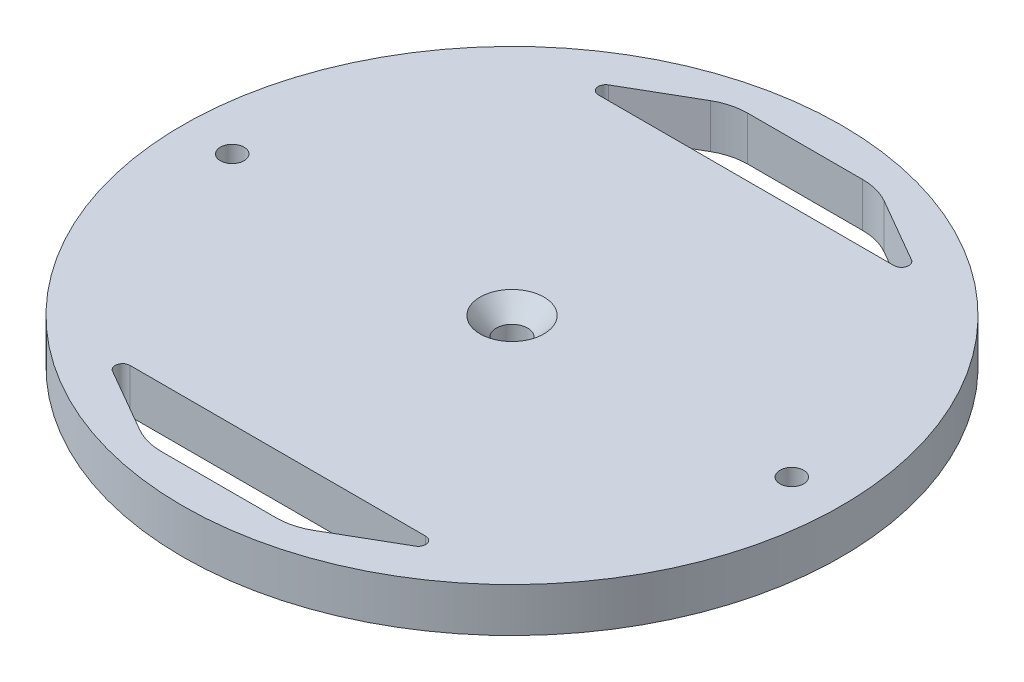
ISO-10303-21;
HEADER;
FILE_DESCRIPTION(('STEP AP214'),'2;1');
FILE_NAME('part.step','',(''),(''),'','','');
FILE_SCHEMA(('AUTOMOTIVE_DESIGN { 1 0 10303 214 1 1 1 1 }'));
ENDSEC;
DATA;
#1=APPLICATION_CONTEXT('core data for automotive mechanical design processes');
#2=APPLICATION_PROTOCOL_DEFINITION('international standard','automotive_design',2000,#1);
#3=PRODUCT_CONTEXT('',#1,'mechanical');
#4=PRODUCT('Part','Part','',(#3));
#5=PRODUCT_RELATED_PRODUCT_CATEGORY('part','',(#4));
#6=PRODUCT_DEFINITION_FORMATION('','',#4);
#7=PRODUCT_DEFINITION_CONTEXT('part definition',#1,'design');
#8=PRODUCT_DEFINITION('design','',#6,#7);
#9=PRODUCT_DEFINITION_SHAPE('','',#8);
#10=(LENGTH_UNIT() NAMED_UNIT(*) SI_UNIT(.MILLI.,.METRE.));
#11=(NAMED_UNIT(*) PLANE_ANGLE_UNIT() SI_UNIT($,.RADIAN.));
#12=(NAMED_UNIT(*) SI_UNIT($,.STERADIAN.) SOLID_ANGLE_UNIT());
#13=UNCERTAINTY_MEASURE_WITH_UNIT(LENGTH_MEASURE(1.E-05),#10,'distance_accuracy_value','');
#14=(GEOMETRIC_REPRESENTATION_CONTEXT(3) GLOBAL_UNCERTAINTY_ASSIGNED_CONTEXT((#13)) GLOBAL_UNIT_ASSIGNED_CONTEXT((#10,
#11,#12)) REPRESENTATION_CONTEXT('',''));
#15=CARTESIAN_POINT('',(0.,0.,0.));
#16=DIRECTION('',(0.,0.,1.));
#17=DIRECTION('',(1.,0.,0.));
#18=AXIS2_PLACEMENT_3D('',#15,#16,#17);
#19=CARTESIAN_POINT('',(0.,9.525,0.));
#20=DIRECTION('',(0.,1.,0.));
#21=DIRECTION('',(0.,0.,1.));
#22=AXIS2_PLACEMENT_3D('',#19,#20,#21);
#23=PLANE('',#22);
#24=DIRECTION('',(1.,0.,0.));
#25=VECTOR('',#24,1.);
#26=CARTESIAN_POINT('',(0.,9.525,-50.5));
#27=LINE('',#26,#25);
#28=CARTESIAN_POINT('',(-31.8753693429843,9.525,-50.5));
#29=VERTEX_POINT('',#28);
#30=CARTESIAN_POINT('',(31.8753693429843,9.525,-50.5));
#31=VERTEX_POINT('',#30);
#32=EDGE_CURVE('E184',#29,#31,#27,.T.);
#33=ORIENTED_EDGE('',*,*,#32,.F.);
#34=CARTESIAN_POINT('',(-31.8753693429843,9.525,-52.0875));
#35=DIRECTION('',(0.,1.,0.));
#36=DIRECTION('',(0.,0.,1.));
#37=AXIS2_PLACEMENT_3D('',#34,#35,#36);
#38=CIRCLE('',#37,1.5875);
#39=CARTESIAN_POINT('',(-32.6691193429843,9.525,-53.4623153285078));
#40=VERTEX_POINT('',#39);
#41=EDGE_CURVE('E241',#29,#40,#38,.F.);
#42=ORIENTED_EDGE('',*,*,#41,.T.);
#43=DIRECTION('',(-0.866025403784442,0.,0.499999999999995));
#44=VECTOR('',#43,1.);
#45=CARTESIAN_POINT('',(-31.3171414455567,9.525,-54.2428801315261));
#46=LINE('',#45,#44);
#47=CARTESIAN_POINT('',(-18.7499999999996,9.525,-61.4985226280624));
#48=VERTEX_POINT('',#47);
#49=EDGE_CURVE('E180',#48,#40,#46,.T.);
#50=ORIENTED_EDGE('',*,*,#49,.F.);
#51=CARTESIAN_POINT('',(-12.3999999999997,9.525,-50.5));
#52=DIRECTION('',(0.,1.,0.));
#53=DIRECTION('',(0.,0.,1.));
#54=AXIS2_PLACEMENT_3D('',#51,#52,#53);
#55=CIRCLE('',#54,12.7);
#56=CARTESIAN_POINT('',(-12.3999999999997,9.525,-63.2));
#57=VERTEX_POINT('',#56);
#58=EDGE_CURVE('E179',#48,#57,#55,.F.);
#59=ORIENTED_EDGE('',*,*,#58,.T.);
#60=DIRECTION('',(-1.,0.,0.));
#61=VECTOR('',#60,1.);
#62=CARTESIAN_POINT('',(0.,9.525,-63.2));
#63=LINE('',#62,#61);
#64=CARTESIAN_POINT('',(12.3999999999997,9.525,-63.2));
#65=VERTEX_POINT('',#64);
#66=EDGE_CURVE('E170',#65,#57,#63,.T.);
#67=ORIENTED_EDGE('',*,*,#66,.F.);
#68=CARTESIAN_POINT('',(12.3999999999997,9.525,-50.5));
#69=DIRECTION('',(0.,1.,0.));
#70=DIRECTION('',(0.,0.,1.));
#71=AXIS2_PLACEMENT_3D('',#68,#69,#70);
#72=CIRCLE('',#71,12.7);
#73=CARTESIAN_POINT('',(18.7499999999996,9.525,-61.4985226280624));
#74=VERTEX_POINT('',#73);
#75=EDGE_CURVE('E153',#65,#74,#72,.F.);
#76=ORIENTED_EDGE('',*,*,#75,.T.);
#77=DIRECTION('',(-0.866025403784442,0.,-0.499999999999995));
#78=VECTOR('',#77,1.);
#79=CARTESIAN_POINT('',(31.3171414455567,9.525,-54.2428801315261));
#80=LINE('',#79,#78);
#81=CARTESIAN_POINT('',(32.6691193429843,9.525,-53.4623153285078));
#82=VERTEX_POINT('',#81);
#83=EDGE_CURVE('E181',#82,#74,#80,.T.);
#84=ORIENTED_EDGE('',*,*,#83,.F.);
#85=CARTESIAN_POINT('',(31.8753693429843,9.525,-52.0875));
#86=DIRECTION('',(0.,1.,0.));
#87=DIRECTION('',(0.,0.,1.));
#88=AXIS2_PLACEMENT_3D('',#85,#86,#87);
#89=CIRCLE('',#88,1.5875);
#90=EDGE_CURVE('E237',#82,#31,#89,.F.);
#91=ORIENTED_EDGE('',*,*,#90,.T.);
#92=EDGE_LOOP('',(#33,#42,#50,#59,#67,#76,#84,#91));
#93=FACE_BOUND('',#92,.T.);
#94=CARTESIAN_POINT('',(0.,9.525,0.));
#95=DIRECTION('',(0.,1.,0.));
#96=DIRECTION('',(0.,0.,1.));
#97=AXIS2_PLACEMENT_3D('',#94,#95,#96);
#98=CIRCLE('',#97,6.8834);
#99=CARTESIAN_POINT('',(0.,9.525,6.8834));
#100=VERTEX_POINT('',#99);
#101=EDGE_CURVE('E192',#100,#100,#98,.T.);
#102=ORIENTED_EDGE('',*,*,#101,.F.);
#103=EDGE_LOOP('',(#102));
#104=FACE_BOUND('',#103,.T.);
#105=CARTESIAN_POINT('',(-60.325,9.525,0.));
#106=DIRECTION('',(0.,1.,0.));
#107=DIRECTION('',(0.,0.,1.));
#108=AXIS2_PLACEMENT_3D('',#105,#106,#107);
#109=CIRCLE('',#108,2.5527);
#110=CARTESIAN_POINT('',(-60.325,9.525,2.5527));
#111=VERTEX_POINT('',#110);
#112=EDGE_CURVE('E201',#111,#111,#109,.T.);
#113=ORIENTED_EDGE('',*,*,#112,.F.);
#114=EDGE_LOOP('',(#113));
#115=FACE_BOUND('',#114,.T.);
#116=CARTESIAN_POINT('',(60.325,9.525,0.));
#117=DIRECTION('',(0.,1.,0.));
#118=DIRECTION('',(0.,0.,1.));
#119=AXIS2_PLACEMENT_3D('',#116,#117,#118);
#120=CIRCLE('',#119,2.5527);
#121=CARTESIAN_POINT('',(60.325,9.525,2.5527));
#122=VERTEX_POINT('',#121);
#123=EDGE_CURVE('E207',#122,#122,#120,.T.);
#124=ORIENTED_EDGE('',*,*,#123,.F.);
#125=EDGE_LOOP('',(#124));
#126=FACE_BOUND('',#125,.T.);
#127=CARTESIAN_POINT('',(0.,9.525,0.));
#128=DIRECTION('',(0.,1.,0.));
#129=DIRECTION('',(0.,0.,1.));
#130=AXIS2_PLACEMENT_3D('',#127,#128,#129);
#131=CIRCLE('',#130,71.0565);
#132=CARTESIAN_POINT('',(0.,9.525,71.0565));
#133=VERTEX_POINT('',#132);
#134=EDGE_CURVE('E214',#133,#133,#131,.T.);
#135=ORIENTED_EDGE('',*,*,#134,.T.);
#136=EDGE_LOOP('',(#135));
#137=FACE_BOUND('',#136,.T.);
#138=DIRECTION('',(-1.,0.,0.));
#139=VECTOR('',#138,1.);
#140=CARTESIAN_POINT('',(0.,9.525,63.2));
#141=LINE('',#140,#139);
#142=CARTESIAN_POINT('',(12.3999999999997,9.525,63.2));
#143=VERTEX_POINT('',#142);
#144=CARTESIAN_POINT('',(-12.3999999999997,9.525,63.2));
#145=VERTEX_POINT('',#144);
#146=EDGE_CURVE('E306',#143,#145,#141,.T.);
#147=ORIENTED_EDGE('',*,*,#146,.T.);
#148=CARTESIAN_POINT('',(-12.3999999999997,9.525,50.5));
#149=DIRECTION('',(0.,1.,0.));
#150=DIRECTION('',(0.,0.,1.));
#151=AXIS2_PLACEMENT_3D('',#148,#149,#150);
#152=CIRCLE('',#151,12.7);
#153=CARTESIAN_POINT('',(-18.7499999999996,9.525,61.4985226280624));
#154=VERTEX_POINT('',#153);
#155=EDGE_CURVE('E260',#145,#154,#152,.F.);
#156=ORIENTED_EDGE('',*,*,#155,.T.);
#157=DIRECTION('',(-0.866025403784442,0.,-0.499999999999995));
#158=VECTOR('',#157,1.);
#159=CARTESIAN_POINT('',(-31.3171414455567,9.525,54.2428801315261));
#160=LINE('',#159,#158);
#161=CARTESIAN_POINT('',(-32.6691193429843,9.525,53.4623153285078));
#162=VERTEX_POINT('',#161);
#163=EDGE_CURVE('E283',#154,#162,#160,.T.);
#164=ORIENTED_EDGE('',*,*,#163,.T.);
#165=CARTESIAN_POINT('',(-31.8753693429843,9.525,52.0875));
#166=DIRECTION('',(0.,1.,0.));
#167=DIRECTION('',(0.,0.,1.));
#168=AXIS2_PLACEMENT_3D('',#165,#166,#167);
#169=CIRCLE('',#168,1.5875);
#170=CARTESIAN_POINT('',(-31.8753693429843,9.525,50.5));
#171=VERTEX_POINT('',#170);
#172=EDGE_CURVE('E47',#162,#171,#169,.F.);
#173=ORIENTED_EDGE('',*,*,#172,.T.);
#174=DIRECTION('',(1.,0.,0.));
#175=VECTOR('',#174,1.);
#176=CARTESIAN_POINT('',(0.,9.525,50.5));
#177=LINE('',#176,#175);
#178=CARTESIAN_POINT('',(31.8753693429843,9.525,50.5));
#179=VERTEX_POINT('',#178);
#180=EDGE_CURVE('E281',#171,#179,#177,.T.);
#181=ORIENTED_EDGE('',*,*,#180,.T.);
#182=CARTESIAN_POINT('',(31.8753693429843,9.525,52.0875));
#183=DIRECTION('',(0.,1.,0.));
#184=DIRECTION('',(0.,0.,1.));
#185=AXIS2_PLACEMENT_3D('',#182,#183,#184);
#186=CIRCLE('',#185,1.5875);
#187=CARTESIAN_POINT('',(32.6691193429843,9.525,53.4623153285078));
#188=VERTEX_POINT('',#187);
#189=EDGE_CURVE('E273',#179,#188,#186,.F.);
#190=ORIENTED_EDGE('',*,*,#189,.T.);
#191=DIRECTION('',(-0.866025403784442,0.,0.499999999999995));
#192=VECTOR('',#191,1.);
#193=CARTESIAN_POINT('',(31.3171414455567,9.525,54.2428801315261));
#194=LINE('',#193,#192);
#195=CARTESIAN_POINT('',(18.7499999999996,9.525,61.4985226280624));
#196=VERTEX_POINT('',#195);
#197=EDGE_CURVE('E289',#188,#196,#194,.T.);
#198=ORIENTED_EDGE('',*,*,#197,.T.);
#199=CARTESIAN_POINT('',(12.3999999999997,9.525,50.5));
#200=DIRECTION('',(0.,1.,0.));
#201=DIRECTION('',(0.,0.,1.));
#202=AXIS2_PLACEMENT_3D('',#199,#200,#201);
#203=CIRCLE('',#202,12.7);
#204=EDGE_CURVE('E255',#196,#143,#203,.F.);
#205=ORIENTED_EDGE('',*,*,#204,.T.);
#206=EDGE_LOOP('',(#147,#156,#164,#173,#181,#190,#198,#205));
#207=FACE_BOUND('',#206,.T.);
#208=ADVANCED_FACE('F39',(#93,#104,#115,#126,#137,#207),#23,.T.);
#209=CARTESIAN_POINT('',(0.,0.,0.));
#210=DIRECTION('',(0.,1.,0.));
#211=DIRECTION('',(0.,0.,1.));
#212=AXIS2_PLACEMENT_3D('',#209,#210,#211);
#213=PLANE('',#212);
#214=CARTESIAN_POINT('',(0.,0.,0.));
#215=DIRECTION('',(0.,1.,0.));
#216=DIRECTION('',(0.,0.,1.));
#217=AXIS2_PLACEMENT_3D('',#214,#215,#216);
#218=CIRCLE('',#217,71.0565);
#219=CARTESIAN_POINT('',(0.,0.,71.0565));
#220=VERTEX_POINT('',#219);
#221=EDGE_CURVE('E213',#220,#220,#218,.T.);
#222=ORIENTED_EDGE('',*,*,#221,.F.);
#223=EDGE_LOOP('',(#222));
#224=FACE_BOUND('',#223,.T.);
#225=CARTESIAN_POINT('',(60.325,0.,0.));
#226=DIRECTION('',(0.,1.,0.));
#227=DIRECTION('',(0.,0.,1.));
#228=AXIS2_PLACEMENT_3D('',#225,#226,#227);
#229=CIRCLE('',#228,2.5527);
#230=CARTESIAN_POINT('',(60.325,0.,2.5527));
#231=VERTEX_POINT('',#230);
#232=EDGE_CURVE('E210',#231,#231,#229,.T.);
#233=ORIENTED_EDGE('',*,*,#232,.T.);
#234=EDGE_LOOP('',(#233));
#235=FACE_BOUND('',#234,.T.);
#236=CARTESIAN_POINT('',(-60.325,0.,0.));
#237=DIRECTION('',(0.,1.,0.));
#238=DIRECTION('',(0.,0.,1.));
#239=AXIS2_PLACEMENT_3D('',#236,#237,#238);
#240=CIRCLE('',#239,2.5527);
#241=CARTESIAN_POINT('',(-60.325,0.,2.5527));
#242=VERTEX_POINT('',#241);
#243=EDGE_CURVE('E204',#242,#242,#240,.T.);
#244=ORIENTED_EDGE('',*,*,#243,.T.);
#245=EDGE_LOOP('',(#244));
#246=FACE_BOUND('',#245,.T.);
#247=CARTESIAN_POINT('',(0.,0.,0.));
#248=DIRECTION('',(0.,1.,0.));
#249=DIRECTION('',(0.,0.,1.));
#250=AXIS2_PLACEMENT_3D('',#247,#248,#249);
#251=CIRCLE('',#250,3.3782);
#252=CARTESIAN_POINT('',(0.,0.,3.3782));
#253=VERTEX_POINT('',#252);
#254=EDGE_CURVE('E198',#253,#253,#251,.T.);
#255=ORIENTED_EDGE('',*,*,#254,.T.);
#256=EDGE_LOOP('',(#255));
#257=FACE_BOUND('',#256,.T.);
#258=DIRECTION('',(-1.,0.,0.));
#259=VECTOR('',#258,1.);
#260=CARTESIAN_POINT('',(-15.8029547438749,0.,-63.2));
#261=LINE('',#260,#259);
#262=CARTESIAN_POINT('',(12.3999999999997,0.,-63.2));
#263=VERTEX_POINT('',#262);
#264=CARTESIAN_POINT('',(-12.3999999999997,0.,-63.2));
#265=VERTEX_POINT('',#264);
#266=EDGE_CURVE('E173',#263,#265,#261,.T.);
#267=ORIENTED_EDGE('',*,*,#266,.T.);
#268=CARTESIAN_POINT('',(-12.3999999999997,0.,-50.5));
#269=DIRECTION('',(0.,1.,0.));
#270=DIRECTION('',(0.,0.,1.));
#271=AXIS2_PLACEMENT_3D('',#268,#269,#270);
#272=CIRCLE('',#271,12.7);
#273=CARTESIAN_POINT('',(-18.7499999999996,0.,-61.4985226280624));
#274=VERTEX_POINT('',#273);
#275=EDGE_CURVE('E225',#265,#274,#272,.T.);
#276=ORIENTED_EDGE('',*,*,#275,.T.);
#277=DIRECTION('',(-0.866025403784442,0.,0.499999999999995));
#278=VECTOR('',#277,1.);
#279=CARTESIAN_POINT('',(-37.8,0.,-50.5));
#280=LINE('',#279,#278);
#281=CARTESIAN_POINT('',(-32.6691193429843,0.,-53.4623153285078));
#282=VERTEX_POINT('',#281);
#283=EDGE_CURVE('E186',#274,#282,#280,.T.);
#284=ORIENTED_EDGE('',*,*,#283,.T.);
#285=CARTESIAN_POINT('',(-31.8753693429843,0.,-52.0875));
#286=DIRECTION('',(0.,1.,0.));
#287=DIRECTION('',(0.,0.,1.));
#288=AXIS2_PLACEMENT_3D('',#285,#286,#287);
#289=CIRCLE('',#288,1.5875);
#290=CARTESIAN_POINT('',(-31.8753693429843,0.,-50.5));
#291=VERTEX_POINT('',#290);
#292=EDGE_CURVE('E243',#282,#291,#289,.T.);
#293=ORIENTED_EDGE('',*,*,#292,.T.);
#294=DIRECTION('',(1.,0.,0.));
#295=VECTOR('',#294,1.);
#296=CARTESIAN_POINT('',(37.8,0.,-50.5));
#297=LINE('',#296,#295);
#298=CARTESIAN_POINT('',(31.8753693429843,0.,-50.5));
#299=VERTEX_POINT('',#298);
#300=EDGE_CURVE('E288',#291,#299,#297,.T.);
#301=ORIENTED_EDGE('',*,*,#300,.T.);
#302=CARTESIAN_POINT('',(31.8753693429843,0.,-52.0875));
#303=DIRECTION('',(0.,1.,0.));
#304=DIRECTION('',(0.,0.,1.));
#305=AXIS2_PLACEMENT_3D('',#302,#303,#304);
#306=CIRCLE('',#305,1.5875);
#307=CARTESIAN_POINT('',(32.6691193429843,0.,-53.4623153285078));
#308=VERTEX_POINT('',#307);
#309=EDGE_CURVE('E239',#299,#308,#306,.T.);
#310=ORIENTED_EDGE('',*,*,#309,.T.);
#311=DIRECTION('',(-0.866025403784442,0.,-0.499999999999995));
#312=VECTOR('',#311,1.);
#313=CARTESIAN_POINT('',(15.8029547438749,0.,-63.2));
#314=LINE('',#313,#312);
#315=CARTESIAN_POINT('',(18.7499999999996,0.,-61.4985226280624));
#316=VERTEX_POINT('',#315);
#317=EDGE_CURVE('E311',#308,#316,#314,.T.);
#318=ORIENTED_EDGE('',*,*,#317,.T.);
#319=CARTESIAN_POINT('',(12.3999999999997,0.,-50.5));
#320=DIRECTION('',(0.,1.,0.));
#321=DIRECTION('',(0.,0.,1.));
#322=AXIS2_PLACEMENT_3D('',#319,#320,#321);
#323=CIRCLE('',#322,12.7);
#324=EDGE_CURVE('E163',#316,#263,#323,.T.);
#325=ORIENTED_EDGE('',*,*,#324,.T.);
#326=EDGE_LOOP('',(#267,#276,#284,#293,#301,#310,#318,#325));
#327=FACE_BOUND('',#326,.T.);
#328=DIRECTION('',(1.,0.,0.));
#329=VECTOR('',#328,1.);
#330=CARTESIAN_POINT('',(37.8,0.,50.5));
#331=LINE('',#330,#329);
#332=CARTESIAN_POINT('',(-31.8753693429843,0.,50.5));
#333=VERTEX_POINT('',#332);
#334=CARTESIAN_POINT('',(31.8753693429843,0.,50.5));
#335=VERTEX_POINT('',#334);
#336=EDGE_CURVE('E297',#333,#335,#331,.T.);
#337=ORIENTED_EDGE('',*,*,#336,.F.);
#338=CARTESIAN_POINT('',(-31.8753693429843,0.,52.0875));
#339=DIRECTION('',(0.,1.,0.));
#340=DIRECTION('',(0.,0.,1.));
#341=AXIS2_PLACEMENT_3D('',#338,#339,#340);
#342=CIRCLE('',#341,1.5875);
#343=CARTESIAN_POINT('',(-32.6691193429843,0.,53.4623153285078));
#344=VERTEX_POINT('',#343);
#345=EDGE_CURVE('E11',#333,#344,#342,.T.);
#346=ORIENTED_EDGE('',*,*,#345,.T.);
#347=DIRECTION('',(-0.866025403784442,0.,-0.499999999999995));
#348=VECTOR('',#347,1.);
#349=CARTESIAN_POINT('',(-37.8,0.,50.5));
#350=LINE('',#349,#348);
#351=CARTESIAN_POINT('',(-18.7499999999996,0.,61.4985226280624));
#352=VERTEX_POINT('',#351);
#353=EDGE_CURVE('E294',#352,#344,#350,.T.);
#354=ORIENTED_EDGE('',*,*,#353,.F.);
#355=CARTESIAN_POINT('',(-12.3999999999997,0.,50.5));
#356=DIRECTION('',(0.,1.,0.));
#357=DIRECTION('',(0.,0.,1.));
#358=AXIS2_PLACEMENT_3D('',#355,#356,#357);
#359=CIRCLE('',#358,12.7);
#360=CARTESIAN_POINT('',(-12.3999999999997,0.,63.2));
#361=VERTEX_POINT('',#360);
#362=EDGE_CURVE('E262',#352,#361,#359,.T.);
#363=ORIENTED_EDGE('',*,*,#362,.T.);
#364=DIRECTION('',(-1.,0.,0.));
#365=VECTOR('',#364,1.);
#366=CARTESIAN_POINT('',(-15.8029547438749,0.,63.2));
#367=LINE('',#366,#365);
#368=CARTESIAN_POINT('',(12.3999999999997,0.,63.2));
#369=VERTEX_POINT('',#368);
#370=EDGE_CURVE('E296',#369,#361,#367,.T.);
#371=ORIENTED_EDGE('',*,*,#370,.F.);
#372=CARTESIAN_POINT('',(12.3999999999997,0.,50.5));
#373=DIRECTION('',(0.,1.,0.));
#374=DIRECTION('',(0.,0.,1.));
#375=AXIS2_PLACEMENT_3D('',#372,#373,#374);
#376=CIRCLE('',#375,12.7);
#377=CARTESIAN_POINT('',(18.7499999999996,0.,61.4985226280624));
#378=VERTEX_POINT('',#377);
#379=EDGE_CURVE('E257',#369,#378,#376,.T.);
#380=ORIENTED_EDGE('',*,*,#379,.T.);
#381=DIRECTION('',(-0.866025403784442,0.,0.499999999999995));
#382=VECTOR('',#381,1.);
#383=CARTESIAN_POINT('',(15.8029547438749,0.,63.2));
#384=LINE('',#383,#382);
#385=CARTESIAN_POINT('',(32.6691193429843,0.,53.4623153285078));
#386=VERTEX_POINT('',#385);
#387=EDGE_CURVE('E300',#386,#378,#384,.T.);
#388=ORIENTED_EDGE('',*,*,#387,.F.);
#389=CARTESIAN_POINT('',(31.8753693429843,0.,52.0875));
#390=DIRECTION('',(0.,1.,0.));
#391=DIRECTION('',(0.,0.,1.));
#392=AXIS2_PLACEMENT_3D('',#389,#390,#391);
#393=CIRCLE('',#392,1.5875);
#394=EDGE_CURVE('E275',#386,#335,#393,.T.);
#395=ORIENTED_EDGE('',*,*,#394,.T.);
#396=EDGE_LOOP('',(#337,#346,#354,#363,#371,#380,#388,#395));
#397=FACE_BOUND('',#396,.T.);
#398=ADVANCED_FACE('F317',(#224,#235,#246,#257,#327,#397),#213,.F.);
#399=CARTESIAN_POINT('',(0.,9.525,0.));
#400=DIRECTION('',(0.,-1.,0.));
#401=DIRECTION('',(0.,0.,-1.));
#402=AXIS2_PLACEMENT_3D('',#399,#400,#401);
#403=CYLINDRICAL_SURFACE('',#402,71.0565);
#404=ORIENTED_EDGE('',*,*,#134,.F.);
#405=EDGE_LOOP('',(#404));
#406=FACE_BOUND('',#405,.T.);
#407=ORIENTED_EDGE('',*,*,#221,.T.);
#408=EDGE_LOOP('',(#407));
#409=FACE_BOUND('',#408,.T.);
#410=ADVANCED_FACE('F356',(#406,#409),#403,.T.);
#411=CARTESIAN_POINT('',(60.325,9.525,0.));
#412=DIRECTION('',(0.,1.,0.));
#413=DIRECTION('',(0.,0.,1.));
#414=AXIS2_PLACEMENT_3D('',#411,#412,#413);
#415=CYLINDRICAL_SURFACE('',#414,2.5527);
#416=ORIENTED_EDGE('',*,*,#232,.F.);
#417=EDGE_LOOP('',(#416));
#418=FACE_BOUND('',#417,.T.);
#419=ORIENTED_EDGE('',*,*,#123,.T.);
#420=EDGE_LOOP('',(#419));
#421=FACE_BOUND('',#420,.T.);
#422=ADVANCED_FACE('F360',(#418,#421),#415,.F.);
#423=CARTESIAN_POINT('',(-60.325,9.525,0.));
#424=DIRECTION('',(0.,1.,0.));
#425=DIRECTION('',(0.,0.,1.));
#426=AXIS2_PLACEMENT_3D('',#423,#424,#425);
#427=CYLINDRICAL_SURFACE('',#426,2.5527);
#428=ORIENTED_EDGE('',*,*,#243,.F.);
#429=EDGE_LOOP('',(#428));
#430=FACE_BOUND('',#429,.T.);
#431=ORIENTED_EDGE('',*,*,#112,.T.);
#432=EDGE_LOOP('',(#431));
#433=FACE_BOUND('',#432,.T.);
#434=ADVANCED_FACE('F518',(#430,#433),#427,.F.);
#435=CARTESIAN_POINT('',(0.,9.525,0.));
#436=DIRECTION('',(0.,1.,0.));
#437=DIRECTION('',(0.,0.,1.));
#438=AXIS2_PLACEMENT_3D('',#435,#436,#437);
#439=CYLINDRICAL_SURFACE('',#438,3.3782);
#440=ORIENTED_EDGE('',*,*,#254,.F.);
#441=EDGE_LOOP('',(#440));
#442=FACE_BOUND('',#441,.T.);
#443=CARTESIAN_POINT('',(0.,5.49272865900891,0.));
#444=DIRECTION('',(0.,1.,0.));
#445=DIRECTION('',(0.,0.,1.));
#446=AXIS2_PLACEMENT_3D('',#443,#444,#445);
#447=CIRCLE('',#446,3.3782);
#448=CARTESIAN_POINT('',(0.,5.49272865900891,3.3782));
#449=VERTEX_POINT('',#448);
#450=EDGE_CURVE('E195',#449,#449,#447,.T.);
#451=ORIENTED_EDGE('',*,*,#450,.T.);
#452=EDGE_LOOP('',(#451));
#453=FACE_BOUND('',#452,.T.);
#454=ADVANCED_FACE('F509',(#442,#453),#439,.F.);
#455=CARTESIAN_POINT('',(0.,9.525,0.));
#456=DIRECTION('',(0.,1.,0.));
#457=DIRECTION('',(0.,0.,1.));
#458=AXIS2_PLACEMENT_3D('',#455,#456,#457);
#459=CONICAL_SURFACE('',#458,6.8834,0.715584993317675);
#460=ORIENTED_EDGE('',*,*,#450,.F.);
#461=EDGE_LOOP('',(#460));
#462=FACE_BOUND('',#461,.T.);
#463=ORIENTED_EDGE('',*,*,#101,.T.);
#464=EDGE_LOOP('',(#463));
#465=FACE_BOUND('',#464,.T.);
#466=ADVANCED_FACE('F347',(#462,#465),#459,.F.);
#467=CARTESIAN_POINT('',(37.8,0.,-50.5));
#468=DIRECTION('',(0.,0.,1.));
#469=DIRECTION('',(1.,0.,0.));
#470=AXIS2_PLACEMENT_3D('',#467,#468,#469);
#471=PLANE('',#470);
#472=ORIENTED_EDGE('',*,*,#32,.T.);
#473=DIRECTION('',(0.,1.,0.));
#474=VECTOR('',#473,1.);
#475=CARTESIAN_POINT('',(31.8753693429843,0.,-50.5));
#476=LINE('',#475,#474);
#477=EDGE_CURVE('E233',#31,#299,#476,.F.);
#478=ORIENTED_EDGE('',*,*,#477,.T.);
#479=ORIENTED_EDGE('',*,*,#300,.F.);
#480=DIRECTION('',(0.,1.,0.));
#481=VECTOR('',#480,1.);
#482=CARTESIAN_POINT('',(-31.8753693429843,9.525,-50.5));
#483=LINE('',#482,#481);
#484=EDGE_CURVE('E230',#291,#29,#483,.T.);
#485=ORIENTED_EDGE('',*,*,#484,.T.);
#486=EDGE_LOOP('',(#472,#478,#479,#485));
#487=FACE_BOUND('',#486,.T.);
#488=ADVANCED_FACE('F327',(#487),#471,.F.);
#489=CARTESIAN_POINT('',(-37.8,0.,-50.5));
#490=DIRECTION('',(-0.499999999999995,0.,-0.866025403784442));
#491=DIRECTION('',(-0.866025403784442,0.,0.499999999999995));
#492=AXIS2_PLACEMENT_3D('',#489,#490,#491);
#493=PLANE('',#492);
#494=ORIENTED_EDGE('',*,*,#49,.T.);
#495=DIRECTION('',(0.,1.,0.));
#496=VECTOR('',#495,1.);
#497=CARTESIAN_POINT('',(-32.6691193429843,0.,-53.4623153285078));
#498=LINE('',#497,#496);
#499=EDGE_CURVE('E235',#40,#282,#498,.F.);
#500=ORIENTED_EDGE('',*,*,#499,.T.);
#501=ORIENTED_EDGE('',*,*,#283,.F.);
#502=DIRECTION('',(0.,1.,0.));
#503=VECTOR('',#502,1.);
#504=CARTESIAN_POINT('',(-18.7499999999996,9.525,-61.4985226280624));
#505=LINE('',#504,#503);
#506=EDGE_CURVE('E164',#274,#48,#505,.T.);
#507=ORIENTED_EDGE('',*,*,#506,.T.);
#508=EDGE_LOOP('',(#494,#500,#501,#507));
#509=FACE_BOUND('',#508,.T.);
#510=ADVANCED_FACE('F338',(#509),#493,.F.);
#511=CARTESIAN_POINT('',(-15.8029547438749,0.,-63.2));
#512=DIRECTION('',(0.,0.,-1.));
#513=DIRECTION('',(-1.,0.,0.));
#514=AXIS2_PLACEMENT_3D('',#511,#512,#513);
#515=PLANE('',#514);
#516=ORIENTED_EDGE('',*,*,#266,.F.);
#517=DIRECTION('',(0.,1.,0.));
#518=VECTOR('',#517,1.);
#519=CARTESIAN_POINT('',(12.3999999999997,9.525,-63.2));
#520=LINE('',#519,#518);
#521=EDGE_CURVE('E157',#263,#65,#520,.T.);
#522=ORIENTED_EDGE('',*,*,#521,.T.);
#523=ORIENTED_EDGE('',*,*,#66,.T.);
#524=DIRECTION('',(0.,1.,0.));
#525=VECTOR('',#524,1.);
#526=CARTESIAN_POINT('',(-12.3999999999997,0.,-63.2));
#527=LINE('',#526,#525);
#528=EDGE_CURVE('E174',#57,#265,#527,.F.);
#529=ORIENTED_EDGE('',*,*,#528,.T.);
#530=EDGE_LOOP('',(#516,#522,#523,#529));
#531=FACE_BOUND('',#530,.T.);
#532=ADVANCED_FACE('F169',(#531),#515,.F.);
#533=CARTESIAN_POINT('',(15.8029547438749,0.,-63.2));
#534=DIRECTION('',(0.499999999999995,0.,-0.866025403784442));
#535=DIRECTION('',(-0.866025403784442,0.,-0.499999999999995));
#536=AXIS2_PLACEMENT_3D('',#533,#534,#535);
#537=PLANE('',#536);
#538=ORIENTED_EDGE('',*,*,#317,.F.);
#539=DIRECTION('',(0.,1.,0.));
#540=VECTOR('',#539,1.);
#541=CARTESIAN_POINT('',(32.6691193429843,9.525,-53.4623153285078));
#542=LINE('',#541,#540);
#543=EDGE_CURVE('E227',#308,#82,#542,.T.);
#544=ORIENTED_EDGE('',*,*,#543,.T.);
#545=ORIENTED_EDGE('',*,*,#83,.T.);
#546=DIRECTION('',(0.,1.,0.));
#547=VECTOR('',#546,1.);
#548=CARTESIAN_POINT('',(18.7499999999996,0.,-61.4985226280624));
#549=LINE('',#548,#547);
#550=EDGE_CURVE('E159',#74,#316,#549,.F.);
#551=ORIENTED_EDGE('',*,*,#550,.T.);
#552=EDGE_LOOP('',(#538,#544,#545,#551));
#553=FACE_BOUND('',#552,.T.);
#554=ADVANCED_FACE('F335',(#553),#537,.F.);
#555=CARTESIAN_POINT('',(12.3999999999997,0.,-50.5));
#556=DIRECTION('',(0.,-1.,0.));
#557=DIRECTION('',(0.,0.,-1.));
#558=AXIS2_PLACEMENT_3D('',#555,#556,#557);
#559=CYLINDRICAL_SURFACE('',#558,12.7);
#560=ORIENTED_EDGE('',*,*,#324,.F.);
#561=ORIENTED_EDGE('',*,*,#550,.F.);
#562=ORIENTED_EDGE('',*,*,#75,.F.);
#563=ORIENTED_EDGE('',*,*,#521,.F.);
#564=EDGE_LOOP('',(#560,#561,#562,#563));
#565=FACE_BOUND('',#564,.T.);
#566=ADVANCED_FACE('F156',(#565),#559,.F.);
#567=CARTESIAN_POINT('',(-12.3999999999997,0.,-50.5));
#568=DIRECTION('',(0.,-1.,0.));
#569=DIRECTION('',(0.,0.,-1.));
#570=AXIS2_PLACEMENT_3D('',#567,#568,#569);
#571=CYLINDRICAL_SURFACE('',#570,12.7);
#572=ORIENTED_EDGE('',*,*,#275,.F.);
#573=ORIENTED_EDGE('',*,*,#528,.F.);
#574=ORIENTED_EDGE('',*,*,#58,.F.);
#575=ORIENTED_EDGE('',*,*,#506,.F.);
#576=EDGE_LOOP('',(#572,#573,#574,#575));
#577=FACE_BOUND('',#576,.T.);
#578=ADVANCED_FACE('F337',(#577),#571,.F.);
#579=CARTESIAN_POINT('',(31.8753693429843,0.,-52.0875));
#580=DIRECTION('',(0.,-1.,0.));
#581=DIRECTION('',(0.,0.,-1.));
#582=AXIS2_PLACEMENT_3D('',#579,#580,#581);
#583=CYLINDRICAL_SURFACE('',#582,1.5875);
#584=ORIENTED_EDGE('',*,*,#309,.F.);
#585=ORIENTED_EDGE('',*,*,#477,.F.);
#586=ORIENTED_EDGE('',*,*,#90,.F.);
#587=ORIENTED_EDGE('',*,*,#543,.F.);
#588=EDGE_LOOP('',(#584,#585,#586,#587));
#589=FACE_BOUND('',#588,.T.);
#590=ADVANCED_FACE('F332',(#589),#583,.F.);
#591=CARTESIAN_POINT('',(-31.8753693429843,0.,-52.0875));
#592=DIRECTION('',(0.,-1.,0.));
#593=DIRECTION('',(0.,0.,-1.));
#594=AXIS2_PLACEMENT_3D('',#591,#592,#593);
#595=CYLINDRICAL_SURFACE('',#594,1.5875);
#596=ORIENTED_EDGE('',*,*,#292,.F.);
#597=ORIENTED_EDGE('',*,*,#499,.F.);
#598=ORIENTED_EDGE('',*,*,#41,.F.);
#599=ORIENTED_EDGE('',*,*,#484,.F.);
#600=EDGE_LOOP('',(#596,#597,#598,#599));
#601=FACE_BOUND('',#600,.T.);
#602=ADVANCED_FACE('F325',(#601),#595,.F.);
#603=CARTESIAN_POINT('',(37.8,0.,50.5));
#604=DIRECTION('',(0.,0.,1.));
#605=DIRECTION('',(1.,0.,0.));
#606=AXIS2_PLACEMENT_3D('',#603,#604,#605);
#607=PLANE('',#606);
#608=ORIENTED_EDGE('',*,*,#336,.T.);
#609=DIRECTION('',(0.,1.,0.));
#610=VECTOR('',#609,1.);
#611=CARTESIAN_POINT('',(31.8753693429843,9.525,50.5));
#612=LINE('',#611,#610);
#613=EDGE_CURVE('E266',#335,#179,#612,.T.);
#614=ORIENTED_EDGE('',*,*,#613,.T.);
#615=ORIENTED_EDGE('',*,*,#180,.F.);
#616=DIRECTION('',(0.,1.,0.));
#617=VECTOR('',#616,1.);
#618=CARTESIAN_POINT('',(-31.8753693429843,0.,50.5));
#619=LINE('',#618,#617);
#620=EDGE_CURVE('E264',#171,#333,#619,.F.);
#621=ORIENTED_EDGE('',*,*,#620,.T.);
#622=EDGE_LOOP('',(#608,#614,#615,#621));
#623=FACE_BOUND('',#622,.T.);
#624=ADVANCED_FACE('F286',(#623),#607,.T.);
#625=CARTESIAN_POINT('',(15.8029547438749,0.,63.2));
#626=DIRECTION('',(-0.499999999999995,0.,-0.866025403784442));
#627=DIRECTION('',(-0.866025403784442,0.,0.499999999999995));
#628=AXIS2_PLACEMENT_3D('',#625,#626,#627);
#629=PLANE('',#628);
#630=ORIENTED_EDGE('',*,*,#197,.F.);
#631=DIRECTION('',(0.,1.,0.));
#632=VECTOR('',#631,1.);
#633=CARTESIAN_POINT('',(32.6691193429843,0.,53.4623153285078));
#634=LINE('',#633,#632);
#635=EDGE_CURVE('E269',#188,#386,#634,.F.);
#636=ORIENTED_EDGE('',*,*,#635,.T.);
#637=ORIENTED_EDGE('',*,*,#387,.T.);
#638=DIRECTION('',(0.,1.,0.));
#639=VECTOR('',#638,1.);
#640=CARTESIAN_POINT('',(18.7499999999996,9.525,61.4985226280624));
#641=LINE('',#640,#639);
#642=EDGE_CURVE('E245',#378,#196,#641,.T.);
#643=ORIENTED_EDGE('',*,*,#642,.T.);
#644=EDGE_LOOP('',(#630,#636,#637,#643));
#645=FACE_BOUND('',#644,.T.);
#646=ADVANCED_FACE('F394',(#645),#629,.T.);
#647=CARTESIAN_POINT('',(-15.8029547438749,0.,63.2));
#648=DIRECTION('',(0.,0.,-1.));
#649=DIRECTION('',(-1.,0.,0.));
#650=AXIS2_PLACEMENT_3D('',#647,#648,#649);
#651=PLANE('',#650);
#652=ORIENTED_EDGE('',*,*,#146,.F.);
#653=DIRECTION('',(0.,1.,0.));
#654=VECTOR('',#653,1.);
#655=CARTESIAN_POINT('',(12.3999999999997,0.,63.2));
#656=LINE('',#655,#654);
#657=EDGE_CURVE('E251',#143,#369,#656,.F.);
#658=ORIENTED_EDGE('',*,*,#657,.T.);
#659=ORIENTED_EDGE('',*,*,#370,.T.);
#660=DIRECTION('',(0.,1.,0.));
#661=VECTOR('',#660,1.);
#662=CARTESIAN_POINT('',(-12.3999999999997,9.525,63.2));
#663=LINE('',#662,#661);
#664=EDGE_CURVE('E248',#361,#145,#663,.T.);
#665=ORIENTED_EDGE('',*,*,#664,.T.);
#666=EDGE_LOOP('',(#652,#658,#659,#665));
#667=FACE_BOUND('',#666,.T.);
#668=ADVANCED_FACE('F399',(#667),#651,.T.);
#669=CARTESIAN_POINT('',(-37.8,0.,50.5));
#670=DIRECTION('',(0.499999999999995,0.,-0.866025403784442));
#671=DIRECTION('',(-0.866025403784442,0.,-0.499999999999995));
#672=AXIS2_PLACEMENT_3D('',#669,#670,#671);
#673=PLANE('',#672);
#674=ORIENTED_EDGE('',*,*,#353,.T.);
#675=DIRECTION('',(0.,1.,0.));
#676=VECTOR('',#675,1.);
#677=CARTESIAN_POINT('',(-32.6691193429843,9.525,53.4623153285078));
#678=LINE('',#677,#676);
#679=EDGE_CURVE('E271',#344,#162,#678,.T.);
#680=ORIENTED_EDGE('',*,*,#679,.T.);
#681=ORIENTED_EDGE('',*,*,#163,.F.);
#682=DIRECTION('',(0.,1.,0.));
#683=VECTOR('',#682,1.);
#684=CARTESIAN_POINT('',(-18.7499999999996,0.,61.4985226280624));
#685=LINE('',#684,#683);
#686=EDGE_CURVE('E253',#154,#352,#685,.F.);
#687=ORIENTED_EDGE('',*,*,#686,.T.);
#688=EDGE_LOOP('',(#674,#680,#681,#687));
#689=FACE_BOUND('',#688,.T.);
#690=ADVANCED_FACE('F292',(#689),#673,.T.);
#691=CARTESIAN_POINT('',(12.3999999999997,0.,50.5));
#692=DIRECTION('',(0.,-1.,0.));
#693=DIRECTION('',(0.,0.,-1.));
#694=AXIS2_PLACEMENT_3D('',#691,#692,#693);
#695=CYLINDRICAL_SURFACE('',#694,12.7);
#696=ORIENTED_EDGE('',*,*,#379,.F.);
#697=ORIENTED_EDGE('',*,*,#657,.F.);
#698=ORIENTED_EDGE('',*,*,#204,.F.);
#699=ORIENTED_EDGE('',*,*,#642,.F.);
#700=EDGE_LOOP('',(#696,#697,#698,#699));
#701=FACE_BOUND('',#700,.T.);
#702=ADVANCED_FACE('F373',(#701),#695,.F.);
#703=CARTESIAN_POINT('',(-12.3999999999997,0.,50.5));
#704=DIRECTION('',(0.,-1.,0.));
#705=DIRECTION('',(0.,0.,-1.));
#706=AXIS2_PLACEMENT_3D('',#703,#704,#705);
#707=CYLINDRICAL_SURFACE('',#706,12.7);
#708=ORIENTED_EDGE('',*,*,#362,.F.);
#709=ORIENTED_EDGE('',*,*,#686,.F.);
#710=ORIENTED_EDGE('',*,*,#155,.F.);
#711=ORIENTED_EDGE('',*,*,#664,.F.);
#712=EDGE_LOOP('',(#708,#709,#710,#711));
#713=FACE_BOUND('',#712,.T.);
#714=ADVANCED_FACE('F376',(#713),#707,.F.);
#715=CARTESIAN_POINT('',(31.8753693429843,0.,52.0875));
#716=DIRECTION('',(0.,-1.,0.));
#717=DIRECTION('',(0.,0.,-1.));
#718=AXIS2_PLACEMENT_3D('',#715,#716,#717);
#719=CYLINDRICAL_SURFACE('',#718,1.5875);
#720=ORIENTED_EDGE('',*,*,#394,.F.);
#721=ORIENTED_EDGE('',*,*,#635,.F.);
#722=ORIENTED_EDGE('',*,*,#189,.F.);
#723=ORIENTED_EDGE('',*,*,#613,.F.);
#724=EDGE_LOOP('',(#720,#721,#722,#723));
#725=FACE_BOUND('',#724,.T.);
#726=ADVANCED_FACE('F379',(#725),#719,.F.);
#727=CARTESIAN_POINT('',(-31.8753693429843,0.,52.0875));
#728=DIRECTION('',(0.,-1.,0.));
#729=DIRECTION('',(0.,0.,-1.));
#730=AXIS2_PLACEMENT_3D('',#727,#728,#729);
#731=CYLINDRICAL_SURFACE('',#730,1.5875);
#732=ORIENTED_EDGE('',*,*,#345,.F.);
#733=ORIENTED_EDGE('',*,*,#620,.F.);
#734=ORIENTED_EDGE('',*,*,#172,.F.);
#735=ORIENTED_EDGE('',*,*,#679,.F.);
#736=EDGE_LOOP('',(#732,#733,#734,#735));
#737=FACE_BOUND('',#736,.T.);
#738=ADVANCED_FACE('F41',(#737),#731,.F.);
#739=CLOSED_SHELL('',(#208,#398,#410,#422,#434,#454,#466,#488,#510,#532,#554,#566,#578,#590,
#602,#624,#646,#668,#690,#702,#714,#726,#738));
#740=MANIFOLD_SOLID_BREP('B2',#739);
#741=ADVANCED_BREP_SHAPE_REPRESENTATION('',(#18,#740),#14);
#742=SHAPE_DEFINITION_REPRESENTATION(#9,#741);
ENDSEC;
END-ISO-10303-21;
